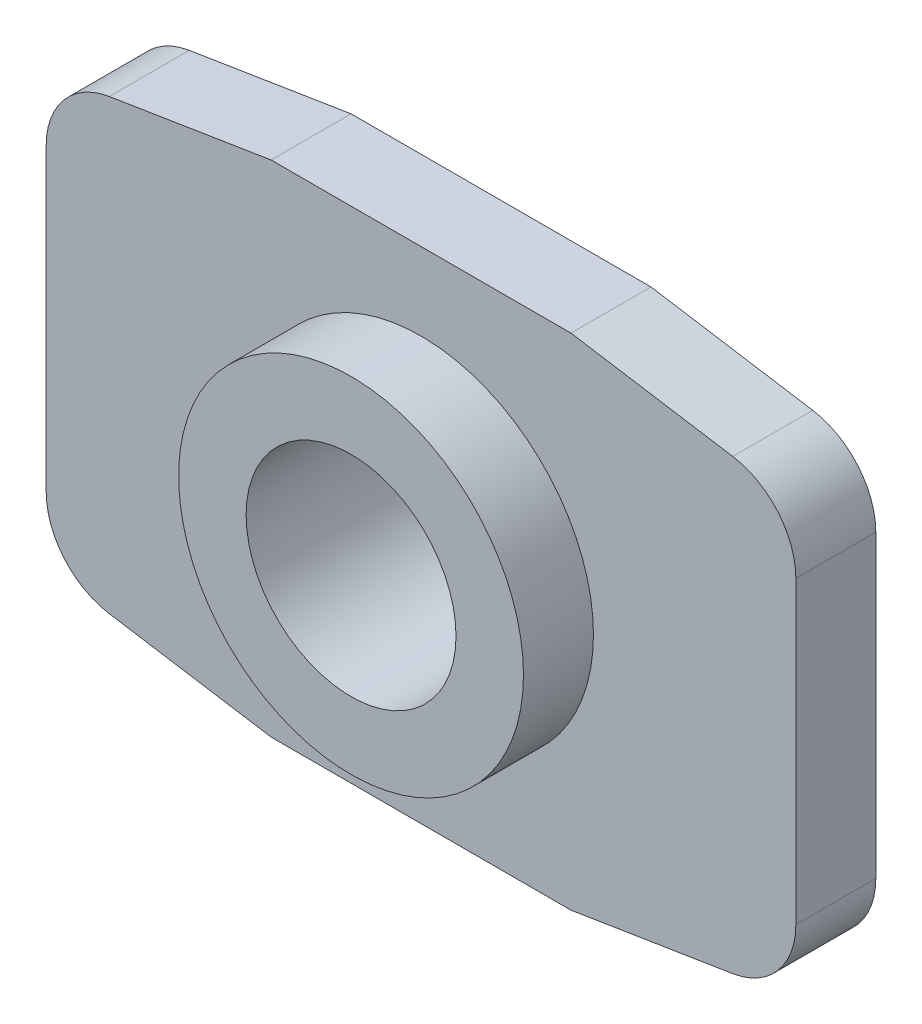
ISO-10303-21;
HEADER;
FILE_DESCRIPTION(('STEP AP214'),'2;1');
FILE_NAME('part.step','',(''),(''),'','','');
FILE_SCHEMA(('AUTOMOTIVE_DESIGN { 1 0 10303 214 1 1 1 1 }'));
ENDSEC;
DATA;
#1=APPLICATION_CONTEXT('core data for automotive mechanical design processes');
#2=APPLICATION_PROTOCOL_DEFINITION('international standard','automotive_design',2000,#1);
#3=PRODUCT_CONTEXT('',#1,'mechanical');
#4=PRODUCT('Part','Part','',(#3));
#5=PRODUCT_RELATED_PRODUCT_CATEGORY('part','',(#4));
#6=PRODUCT_DEFINITION_FORMATION('','',#4);
#7=PRODUCT_DEFINITION_CONTEXT('part definition',#1,'design');
#8=PRODUCT_DEFINITION('design','',#6,#7);
#9=PRODUCT_DEFINITION_SHAPE('','',#8);
#10=(LENGTH_UNIT() NAMED_UNIT(*) SI_UNIT(.MILLI.,.METRE.));
#11=(NAMED_UNIT(*) PLANE_ANGLE_UNIT() SI_UNIT($,.RADIAN.));
#12=(NAMED_UNIT(*) SI_UNIT($,.STERADIAN.) SOLID_ANGLE_UNIT());
#13=UNCERTAINTY_MEASURE_WITH_UNIT(LENGTH_MEASURE(1.E-05),#10,'distance_accuracy_value','');
#14=(GEOMETRIC_REPRESENTATION_CONTEXT(3) GLOBAL_UNCERTAINTY_ASSIGNED_CONTEXT((#13)) GLOBAL_UNIT_ASSIGNED_CONTEXT((#10,
#11,#12)) REPRESENTATION_CONTEXT('',''));
#15=CARTESIAN_POINT('',(0.,0.,0.));
#16=DIRECTION('',(0.,0.,1.));
#17=DIRECTION('',(1.,0.,0.));
#18=AXIS2_PLACEMENT_3D('',#15,#16,#17);
#19=CARTESIAN_POINT('',(6.,3.,1.6));
#20=DIRECTION('',(0.,0.,1.));
#21=DIRECTION('',(1.,0.,0.));
#22=AXIS2_PLACEMENT_3D('',#19,#20,#21);
#23=PLANE('',#22);
#24=CARTESIAN_POINT('',(6.,3.,1.6));
#25=DIRECTION('',(0.,0.,1.));
#26=DIRECTION('',(1.,0.,0.));
#27=AXIS2_PLACEMENT_3D('',#24,#25,#26);
#28=CIRCLE('',#27,1.5);
#29=CARTESIAN_POINT('',(7.5,3.,1.6));
#30=VERTEX_POINT('',#29);
#31=CARTESIAN_POINT('',(6.23739675280407,4.48109512920611,1.6));
#32=VERTEX_POINT('',#31);
#33=EDGE_CURVE('E178',#30,#32,#28,.T.);
#34=ORIENTED_EDGE('',*,*,#33,.T.);
#35=DIRECTION('',(-0.987396752804077,0.158264501869385,0.));
#36=VECTOR('',#35,1.);
#37=CARTESIAN_POINT('',(6.23739675280407,4.48109512920611,1.6));
#38=LINE('',#37,#36);
#39=CARTESIAN_POINT('',(3.,5.,1.6));
#40=VERTEX_POINT('',#39);
#41=EDGE_CURVE('E106',#32,#40,#38,.T.);
#42=ORIENTED_EDGE('',*,*,#41,.T.);
#43=DIRECTION('',(-1.,0.,0.));
#44=VECTOR('',#43,1.);
#45=CARTESIAN_POINT('',(-3.,5.,1.6));
#46=LINE('',#45,#44);
#47=CARTESIAN_POINT('',(-3.,5.,1.6));
#48=VERTEX_POINT('',#47);
#49=EDGE_CURVE('E205',#40,#48,#46,.T.);
#50=ORIENTED_EDGE('',*,*,#49,.T.);
#51=DIRECTION('',(-0.987396752804077,-0.158264501869386,0.));
#52=VECTOR('',#51,1.);
#53=CARTESIAN_POINT('',(-6.23739675280407,4.48109512920611,1.6));
#54=LINE('',#53,#52);
#55=CARTESIAN_POINT('',(-6.23739675280407,4.48109512920611,1.6));
#56=VERTEX_POINT('',#55);
#57=EDGE_CURVE('E223',#48,#56,#54,.T.);
#58=ORIENTED_EDGE('',*,*,#57,.T.);
#59=CARTESIAN_POINT('',(-6.,3.,1.6));
#60=DIRECTION('',(0.,0.,1.));
#61=DIRECTION('',(-1.,0.,0.));
#62=AXIS2_PLACEMENT_3D('',#59,#60,#61);
#63=CIRCLE('',#62,1.5);
#64=CARTESIAN_POINT('',(-7.5,3.,1.6));
#65=VERTEX_POINT('',#64);
#66=EDGE_CURVE('E220',#56,#65,#63,.T.);
#67=ORIENTED_EDGE('',*,*,#66,.T.);
#68=DIRECTION('',(0.,-1.,0.));
#69=VECTOR('',#68,1.);
#70=CARTESIAN_POINT('',(-7.5,-3.,1.6));
#71=LINE('',#70,#69);
#72=CARTESIAN_POINT('',(-7.5,-3.,1.6));
#73=VERTEX_POINT('',#72);
#74=EDGE_CURVE('E222',#65,#73,#71,.T.);
#75=ORIENTED_EDGE('',*,*,#74,.T.);
#76=CARTESIAN_POINT('',(-6.,-3.,1.6));
#77=DIRECTION('',(0.,0.,1.));
#78=DIRECTION('',(1.,0.,0.));
#79=AXIS2_PLACEMENT_3D('',#76,#77,#78);
#80=CIRCLE('',#79,1.5);
#81=CARTESIAN_POINT('',(-6.23739675280407,-4.48109512920612,1.6));
#82=VERTEX_POINT('',#81);
#83=EDGE_CURVE('E225',#73,#82,#80,.T.);
#84=ORIENTED_EDGE('',*,*,#83,.T.);
#85=DIRECTION('',(0.987396752804077,-0.158264501869385,0.));
#86=VECTOR('',#85,1.);
#87=CARTESIAN_POINT('',(-6.23739675280407,-4.48109512920612,1.6));
#88=LINE('',#87,#86);
#89=CARTESIAN_POINT('',(-3.,-5.,1.6));
#90=VERTEX_POINT('',#89);
#91=EDGE_CURVE('E231',#82,#90,#88,.T.);
#92=ORIENTED_EDGE('',*,*,#91,.T.);
#93=DIRECTION('',(1.,0.,0.));
#94=VECTOR('',#93,1.);
#95=CARTESIAN_POINT('',(-3.,-5.,1.6));
#96=LINE('',#95,#94);
#97=CARTESIAN_POINT('',(3.,-5.,1.6));
#98=VERTEX_POINT('',#97);
#99=EDGE_CURVE('E137',#90,#98,#96,.T.);
#100=ORIENTED_EDGE('',*,*,#99,.T.);
#101=DIRECTION('',(0.987396752804077,0.158264501869385,0.));
#102=VECTOR('',#101,1.);
#103=CARTESIAN_POINT('',(6.23739675280407,-4.48109512920611,1.6));
#104=LINE('',#103,#102);
#105=CARTESIAN_POINT('',(6.23739675280407,-4.48109512920612,1.6));
#106=VERTEX_POINT('',#105);
#107=EDGE_CURVE('E131',#98,#106,#104,.T.);
#108=ORIENTED_EDGE('',*,*,#107,.T.);
#109=CARTESIAN_POINT('',(6.,-3.,1.6));
#110=DIRECTION('',(0.,0.,1.));
#111=DIRECTION('',(-1.,0.,0.));
#112=AXIS2_PLACEMENT_3D('',#109,#110,#111);
#113=CIRCLE('',#112,1.5);
#114=CARTESIAN_POINT('',(7.5,-3.,1.6));
#115=VERTEX_POINT('',#114);
#116=EDGE_CURVE('E135',#106,#115,#113,.T.);
#117=ORIENTED_EDGE('',*,*,#116,.T.);
#118=DIRECTION('',(0.,1.,0.));
#119=VECTOR('',#118,1.);
#120=CARTESIAN_POINT('',(7.5,-3.,1.6));
#121=LINE('',#120,#119);
#122=EDGE_CURVE('E51',#115,#30,#121,.T.);
#123=ORIENTED_EDGE('',*,*,#122,.T.);
#124=EDGE_LOOP('',(#34,#42,#50,#58,#67,#75,#84,#92,#100,#108,#117,#123));
#125=FACE_BOUND('',#124,.T.);
#126=CARTESIAN_POINT('',(0.,0.,1.6));
#127=DIRECTION('',(0.,0.,1.));
#128=DIRECTION('',(1.,0.,0.));
#129=AXIS2_PLACEMENT_3D('',#126,#127,#128);
#130=CIRCLE('',#129,3.45);
#131=CARTESIAN_POINT('',(3.45,0.,1.6));
#132=VERTEX_POINT('',#131);
#133=EDGE_CURVE('E283',#132,#132,#130,.T.);
#134=ORIENTED_EDGE('',*,*,#133,.F.);
#135=EDGE_LOOP('',(#134));
#136=FACE_BOUND('',#135,.T.);
#137=ADVANCED_FACE('F34',(#125,#136),#23,.T.);
#138=CARTESIAN_POINT('',(6.,3.,1.6));
#139=DIRECTION('',(0.,0.,-1.));
#140=DIRECTION('',(-1.,0.,0.));
#141=AXIS2_PLACEMENT_3D('',#138,#139,#140);
#142=CYLINDRICAL_SURFACE('',#141,1.5);
#143=CARTESIAN_POINT('',(6.,3.,0.));
#144=DIRECTION('',(0.,0.,1.));
#145=DIRECTION('',(1.,0.,0.));
#146=AXIS2_PLACEMENT_3D('',#143,#144,#145);
#147=CIRCLE('',#146,1.5);
#148=CARTESIAN_POINT('',(7.5,3.,0.));
#149=VERTEX_POINT('',#148);
#150=CARTESIAN_POINT('',(6.23739675280407,4.48109512920611,0.));
#151=VERTEX_POINT('',#150);
#152=EDGE_CURVE('E155',#149,#151,#147,.T.);
#153=ORIENTED_EDGE('',*,*,#152,.T.);
#154=DIRECTION('',(0.,0.,-1.));
#155=VECTOR('',#154,1.);
#156=CARTESIAN_POINT('',(6.23739675280407,4.48109512920611,1.6));
#157=LINE('',#156,#155);
#158=EDGE_CURVE('E11',#32,#151,#157,.T.);
#159=ORIENTED_EDGE('',*,*,#158,.F.);
#160=ORIENTED_EDGE('',*,*,#33,.F.);
#161=DIRECTION('',(0.,0.,-1.));
#162=VECTOR('',#161,1.);
#163=CARTESIAN_POINT('',(7.5,3.,1.6));
#164=LINE('',#163,#162);
#165=EDGE_CURVE('E151',#30,#149,#164,.T.);
#166=ORIENTED_EDGE('',*,*,#165,.T.);
#167=EDGE_LOOP('',(#153,#159,#160,#166));
#168=FACE_BOUND('',#167,.T.);
#169=ADVANCED_FACE('F36',(#168),#142,.T.);
#170=CARTESIAN_POINT('',(6.23739675280407,4.48109512920611,1.6));
#171=DIRECTION('',(-0.158264501869385,-0.987396752804077,0.));
#172=DIRECTION('',(0.987396752804077,-0.158264501869385,0.));
#173=AXIS2_PLACEMENT_3D('',#170,#171,#172);
#174=PLANE('',#173);
#175=DIRECTION('',(-0.987396752804077,0.158264501869385,0.));
#176=VECTOR('',#175,1.);
#177=CARTESIAN_POINT('',(6.23739675280407,4.48109512920611,0.));
#178=LINE('',#177,#176);
#179=CARTESIAN_POINT('',(3.,5.,0.));
#180=VERTEX_POINT('',#179);
#181=EDGE_CURVE('E158',#151,#180,#178,.T.);
#182=ORIENTED_EDGE('',*,*,#181,.T.);
#183=DIRECTION('',(0.,0.,-1.));
#184=VECTOR('',#183,1.);
#185=CARTESIAN_POINT('',(3.,5.,1.6));
#186=LINE('',#185,#184);
#187=EDGE_CURVE('E43',#40,#180,#186,.T.);
#188=ORIENTED_EDGE('',*,*,#187,.F.);
#189=ORIENTED_EDGE('',*,*,#41,.F.);
#190=ORIENTED_EDGE('',*,*,#158,.T.);
#191=EDGE_LOOP('',(#182,#188,#189,#190));
#192=FACE_BOUND('',#191,.T.);
#193=ADVANCED_FACE('F261',(#192),#174,.F.);
#194=CARTESIAN_POINT('',(-3.,5.,1.6));
#195=DIRECTION('',(0.,-1.,0.));
#196=DIRECTION('',(0.,0.,-1.));
#197=AXIS2_PLACEMENT_3D('',#194,#195,#196);
#198=PLANE('',#197);
#199=DIRECTION('',(-1.,0.,0.));
#200=VECTOR('',#199,1.);
#201=CARTESIAN_POINT('',(-3.,5.,0.));
#202=LINE('',#201,#200);
#203=CARTESIAN_POINT('',(-3.,5.,0.));
#204=VERTEX_POINT('',#203);
#205=EDGE_CURVE('E161',#180,#204,#202,.T.);
#206=ORIENTED_EDGE('',*,*,#205,.T.);
#207=DIRECTION('',(0.,0.,-1.));
#208=VECTOR('',#207,1.);
#209=CARTESIAN_POINT('',(-3.,5.,1.6));
#210=LINE('',#209,#208);
#211=EDGE_CURVE('E197',#48,#204,#210,.T.);
#212=ORIENTED_EDGE('',*,*,#211,.F.);
#213=ORIENTED_EDGE('',*,*,#49,.F.);
#214=ORIENTED_EDGE('',*,*,#187,.T.);
#215=EDGE_LOOP('',(#206,#212,#213,#214));
#216=FACE_BOUND('',#215,.T.);
#217=ADVANCED_FACE('F203',(#216),#198,.F.);
#218=CARTESIAN_POINT('',(-6.23739675280407,4.48109512920611,1.6));
#219=DIRECTION('',(0.158264501869386,-0.987396752804077,0.));
#220=DIRECTION('',(0.987396752804077,0.158264501869386,0.));
#221=AXIS2_PLACEMENT_3D('',#218,#219,#220);
#222=PLANE('',#221);
#223=DIRECTION('',(-0.987396752804077,-0.158264501869386,0.));
#224=VECTOR('',#223,1.);
#225=CARTESIAN_POINT('',(-6.23739675280407,4.48109512920611,0.));
#226=LINE('',#225,#224);
#227=CARTESIAN_POINT('',(-6.23739675280407,4.48109512920611,0.));
#228=VERTEX_POINT('',#227);
#229=EDGE_CURVE('E163',#204,#228,#226,.T.);
#230=ORIENTED_EDGE('',*,*,#229,.T.);
#231=DIRECTION('',(0.,0.,-1.));
#232=VECTOR('',#231,1.);
#233=CARTESIAN_POINT('',(-6.23739675280407,4.48109512920611,1.6));
#234=LINE('',#233,#232);
#235=EDGE_CURVE('E194',#56,#228,#234,.T.);
#236=ORIENTED_EDGE('',*,*,#235,.F.);
#237=ORIENTED_EDGE('',*,*,#57,.F.);
#238=ORIENTED_EDGE('',*,*,#211,.T.);
#239=EDGE_LOOP('',(#230,#236,#237,#238));
#240=FACE_BOUND('',#239,.T.);
#241=ADVANCED_FACE('F214',(#240),#222,.F.);
#242=CARTESIAN_POINT('',(-6.,3.,1.6));
#243=DIRECTION('',(0.,0.,-1.));
#244=DIRECTION('',(-1.,0.,0.));
#245=AXIS2_PLACEMENT_3D('',#242,#243,#244);
#246=CYLINDRICAL_SURFACE('',#245,1.5);
#247=CARTESIAN_POINT('',(-6.,3.,0.));
#248=DIRECTION('',(0.,0.,1.));
#249=DIRECTION('',(-1.,0.,0.));
#250=AXIS2_PLACEMENT_3D('',#247,#248,#249);
#251=CIRCLE('',#250,1.5);
#252=CARTESIAN_POINT('',(-7.5,3.,0.));
#253=VERTEX_POINT('',#252);
#254=EDGE_CURVE('E165',#228,#253,#251,.T.);
#255=ORIENTED_EDGE('',*,*,#254,.T.);
#256=DIRECTION('',(0.,0.,-1.));
#257=VECTOR('',#256,1.);
#258=CARTESIAN_POINT('',(-7.5,3.,1.6));
#259=LINE('',#258,#257);
#260=EDGE_CURVE('E191',#65,#253,#259,.T.);
#261=ORIENTED_EDGE('',*,*,#260,.F.);
#262=ORIENTED_EDGE('',*,*,#66,.F.);
#263=ORIENTED_EDGE('',*,*,#235,.T.);
#264=EDGE_LOOP('',(#255,#261,#262,#263));
#265=FACE_BOUND('',#264,.T.);
#266=ADVANCED_FACE('F218',(#265),#246,.T.);
#267=CARTESIAN_POINT('',(-7.5,-3.,1.6));
#268=DIRECTION('',(1.,0.,0.));
#269=DIRECTION('',(0.,0.,-1.));
#270=AXIS2_PLACEMENT_3D('',#267,#268,#269);
#271=PLANE('',#270);
#272=DIRECTION('',(0.,-1.,0.));
#273=VECTOR('',#272,1.);
#274=CARTESIAN_POINT('',(-7.5,-3.,0.));
#275=LINE('',#274,#273);
#276=CARTESIAN_POINT('',(-7.5,-3.,0.));
#277=VERTEX_POINT('',#276);
#278=EDGE_CURVE('E167',#253,#277,#275,.T.);
#279=ORIENTED_EDGE('',*,*,#278,.T.);
#280=DIRECTION('',(0.,0.,-1.));
#281=VECTOR('',#280,1.);
#282=CARTESIAN_POINT('',(-7.5,-3.,1.6));
#283=LINE('',#282,#281);
#284=EDGE_CURVE('E188',#73,#277,#283,.T.);
#285=ORIENTED_EDGE('',*,*,#284,.F.);
#286=ORIENTED_EDGE('',*,*,#74,.F.);
#287=ORIENTED_EDGE('',*,*,#260,.T.);
#288=EDGE_LOOP('',(#279,#285,#286,#287));
#289=FACE_BOUND('',#288,.T.);
#290=ADVANCED_FACE('F361',(#289),#271,.F.);
#291=CARTESIAN_POINT('',(-6.,-3.,1.6));
#292=DIRECTION('',(0.,0.,-1.));
#293=DIRECTION('',(-1.,0.,0.));
#294=AXIS2_PLACEMENT_3D('',#291,#292,#293);
#295=CYLINDRICAL_SURFACE('',#294,1.5);
#296=CARTESIAN_POINT('',(-6.,-3.,0.));
#297=DIRECTION('',(0.,0.,1.));
#298=DIRECTION('',(1.,0.,0.));
#299=AXIS2_PLACEMENT_3D('',#296,#297,#298);
#300=CIRCLE('',#299,1.5);
#301=CARTESIAN_POINT('',(-6.23739675280407,-4.48109512920612,0.));
#302=VERTEX_POINT('',#301);
#303=EDGE_CURVE('E169',#277,#302,#300,.T.);
#304=ORIENTED_EDGE('',*,*,#303,.T.);
#305=DIRECTION('',(0.,0.,-1.));
#306=VECTOR('',#305,1.);
#307=CARTESIAN_POINT('',(-6.23739675280407,-4.48109512920612,1.6));
#308=LINE('',#307,#306);
#309=EDGE_CURVE('E185',#82,#302,#308,.T.);
#310=ORIENTED_EDGE('',*,*,#309,.F.);
#311=ORIENTED_EDGE('',*,*,#83,.F.);
#312=ORIENTED_EDGE('',*,*,#284,.T.);
#313=EDGE_LOOP('',(#304,#310,#311,#312));
#314=FACE_BOUND('',#313,.T.);
#315=ADVANCED_FACE('F352',(#314),#295,.T.);
#316=CARTESIAN_POINT('',(-6.23739675280407,-4.48109512920612,1.6));
#317=DIRECTION('',(0.158264501869385,0.987396752804077,0.));
#318=DIRECTION('',(-0.987396752804077,0.158264501869385,0.));
#319=AXIS2_PLACEMENT_3D('',#316,#317,#318);
#320=PLANE('',#319);
#321=DIRECTION('',(0.987396752804077,-0.158264501869385,0.));
#322=VECTOR('',#321,1.);
#323=CARTESIAN_POINT('',(-6.23739675280407,-4.48109512920612,0.));
#324=LINE('',#323,#322);
#325=CARTESIAN_POINT('',(-3.,-5.,0.));
#326=VERTEX_POINT('',#325);
#327=EDGE_CURVE('E171',#302,#326,#324,.T.);
#328=ORIENTED_EDGE('',*,*,#327,.T.);
#329=DIRECTION('',(0.,0.,-1.));
#330=VECTOR('',#329,1.);
#331=CARTESIAN_POINT('',(-3.,-5.,1.6));
#332=LINE('',#331,#330);
#333=EDGE_CURVE('E182',#90,#326,#332,.T.);
#334=ORIENTED_EDGE('',*,*,#333,.F.);
#335=ORIENTED_EDGE('',*,*,#91,.F.);
#336=ORIENTED_EDGE('',*,*,#309,.T.);
#337=EDGE_LOOP('',(#328,#334,#335,#336));
#338=FACE_BOUND('',#337,.T.);
#339=ADVANCED_FACE('F237',(#338),#320,.F.);
#340=CARTESIAN_POINT('',(-3.,-5.,1.6));
#341=DIRECTION('',(0.,1.,0.));
#342=DIRECTION('',(0.,0.,1.));
#343=AXIS2_PLACEMENT_3D('',#340,#341,#342);
#344=PLANE('',#343);
#345=DIRECTION('',(1.,0.,0.));
#346=VECTOR('',#345,1.);
#347=CARTESIAN_POINT('',(-3.,-5.,0.));
#348=LINE('',#347,#346);
#349=CARTESIAN_POINT('',(3.,-5.,0.));
#350=VERTEX_POINT('',#349);
#351=EDGE_CURVE('E173',#326,#350,#348,.T.);
#352=ORIENTED_EDGE('',*,*,#351,.T.);
#353=DIRECTION('',(0.,0.,-1.));
#354=VECTOR('',#353,1.);
#355=CARTESIAN_POINT('',(3.,-5.,1.6));
#356=LINE('',#355,#354);
#357=EDGE_CURVE('E146',#98,#350,#356,.T.);
#358=ORIENTED_EDGE('',*,*,#357,.F.);
#359=ORIENTED_EDGE('',*,*,#99,.F.);
#360=ORIENTED_EDGE('',*,*,#333,.T.);
#361=EDGE_LOOP('',(#352,#358,#359,#360));
#362=FACE_BOUND('',#361,.T.);
#363=ADVANCED_FACE('F241',(#362),#344,.F.);
#364=CARTESIAN_POINT('',(6.23739675280407,-4.48109512920611,1.6));
#365=DIRECTION('',(-0.158264501869385,0.987396752804077,0.));
#366=DIRECTION('',(-0.987396752804077,-0.158264501869385,0.));
#367=AXIS2_PLACEMENT_3D('',#364,#365,#366);
#368=PLANE('',#367);
#369=DIRECTION('',(0.987396752804077,0.158264501869385,0.));
#370=VECTOR('',#369,1.);
#371=CARTESIAN_POINT('',(6.23739675280407,-4.48109512920611,0.));
#372=LINE('',#371,#370);
#373=CARTESIAN_POINT('',(6.23739675280407,-4.48109512920612,0.));
#374=VERTEX_POINT('',#373);
#375=EDGE_CURVE('E145',#350,#374,#372,.T.);
#376=ORIENTED_EDGE('',*,*,#375,.T.);
#377=DIRECTION('',(0.,0.,-1.));
#378=VECTOR('',#377,1.);
#379=CARTESIAN_POINT('',(6.23739675280407,-4.48109512920612,1.6));
#380=LINE('',#379,#378);
#381=EDGE_CURVE('E142',#106,#374,#380,.T.);
#382=ORIENTED_EDGE('',*,*,#381,.F.);
#383=ORIENTED_EDGE('',*,*,#107,.F.);
#384=ORIENTED_EDGE('',*,*,#357,.T.);
#385=EDGE_LOOP('',(#376,#382,#383,#384));
#386=FACE_BOUND('',#385,.T.);
#387=ADVANCED_FACE('F143',(#386),#368,.F.);
#388=CARTESIAN_POINT('',(6.,-3.,1.6));
#389=DIRECTION('',(0.,0.,-1.));
#390=DIRECTION('',(-1.,0.,0.));
#391=AXIS2_PLACEMENT_3D('',#388,#389,#390);
#392=CYLINDRICAL_SURFACE('',#391,1.5);
#393=CARTESIAN_POINT('',(6.,-3.,0.));
#394=DIRECTION('',(0.,0.,1.));
#395=DIRECTION('',(-1.,0.,0.));
#396=AXIS2_PLACEMENT_3D('',#393,#394,#395);
#397=CIRCLE('',#396,1.5);
#398=CARTESIAN_POINT('',(7.5,-3.,0.));
#399=VERTEX_POINT('',#398);
#400=EDGE_CURVE('E92',#374,#399,#397,.T.);
#401=ORIENTED_EDGE('',*,*,#400,.T.);
#402=DIRECTION('',(0.,0.,-1.));
#403=VECTOR('',#402,1.);
#404=CARTESIAN_POINT('',(7.5,-3.,1.6));
#405=LINE('',#404,#403);
#406=EDGE_CURVE('E147',#115,#399,#405,.T.);
#407=ORIENTED_EDGE('',*,*,#406,.F.);
#408=ORIENTED_EDGE('',*,*,#116,.F.);
#409=ORIENTED_EDGE('',*,*,#381,.T.);
#410=EDGE_LOOP('',(#401,#407,#408,#409));
#411=FACE_BOUND('',#410,.T.);
#412=ADVANCED_FACE('F149',(#411),#392,.T.);
#413=CARTESIAN_POINT('',(7.5,-3.,1.6));
#414=DIRECTION('',(-1.,0.,0.));
#415=DIRECTION('',(0.,-1.,0.));
#416=AXIS2_PLACEMENT_3D('',#413,#414,#415);
#417=PLANE('',#416);
#418=DIRECTION('',(0.,1.,0.));
#419=VECTOR('',#418,1.);
#420=CARTESIAN_POINT('',(7.5,-3.,0.));
#421=LINE('',#420,#419);
#422=EDGE_CURVE('E98',#399,#149,#421,.T.);
#423=ORIENTED_EDGE('',*,*,#422,.T.);
#424=ORIENTED_EDGE('',*,*,#165,.F.);
#425=ORIENTED_EDGE('',*,*,#122,.F.);
#426=ORIENTED_EDGE('',*,*,#406,.T.);
#427=EDGE_LOOP('',(#423,#424,#425,#426));
#428=FACE_BOUND('',#427,.T.);
#429=ADVANCED_FACE('F245',(#428),#417,.F.);
#430=CARTESIAN_POINT('',(6.,3.,0.));
#431=DIRECTION('',(0.,0.,1.));
#432=DIRECTION('',(1.,0.,0.));
#433=AXIS2_PLACEMENT_3D('',#430,#431,#432);
#434=PLANE('',#433);
#435=CARTESIAN_POINT('',(0.,0.,0.));
#436=DIRECTION('',(0.,0.,1.));
#437=DIRECTION('',(1.,0.,0.));
#438=AXIS2_PLACEMENT_3D('',#435,#436,#437);
#439=CIRCLE('',#438,2.1);
#440=CARTESIAN_POINT('',(2.1,0.,0.));
#441=VERTEX_POINT('',#440);
#442=EDGE_CURVE('E278',#441,#441,#439,.T.);
#443=ORIENTED_EDGE('',*,*,#442,.T.);
#444=EDGE_LOOP('',(#443));
#445=FACE_BOUND('',#444,.T.);
#446=ORIENTED_EDGE('',*,*,#152,.F.);
#447=ORIENTED_EDGE('',*,*,#422,.F.);
#448=ORIENTED_EDGE('',*,*,#400,.F.);
#449=ORIENTED_EDGE('',*,*,#375,.F.);
#450=ORIENTED_EDGE('',*,*,#351,.F.);
#451=ORIENTED_EDGE('',*,*,#327,.F.);
#452=ORIENTED_EDGE('',*,*,#303,.F.);
#453=ORIENTED_EDGE('',*,*,#278,.F.);
#454=ORIENTED_EDGE('',*,*,#254,.F.);
#455=ORIENTED_EDGE('',*,*,#229,.F.);
#456=ORIENTED_EDGE('',*,*,#205,.F.);
#457=ORIENTED_EDGE('',*,*,#181,.F.);
#458=EDGE_LOOP('',(#446,#447,#448,#449,#450,#451,#452,#453,#454,#455,#456,#457));
#459=FACE_BOUND('',#458,.T.);
#460=ADVANCED_FACE('F209',(#445,#459),#434,.F.);
#461=CARTESIAN_POINT('',(0.,0.,3.));
#462=DIRECTION('',(0.,0.,-1.));
#463=DIRECTION('',(-1.,0.,0.));
#464=AXIS2_PLACEMENT_3D('',#461,#462,#463);
#465=CYLINDRICAL_SURFACE('',#464,3.45);
#466=CARTESIAN_POINT('',(0.,0.,3.));
#467=DIRECTION('',(0.,0.,1.));
#468=DIRECTION('',(1.,0.,0.));
#469=AXIS2_PLACEMENT_3D('',#466,#467,#468);
#470=CIRCLE('',#469,3.45);
#471=CARTESIAN_POINT('',(3.45,0.,3.));
#472=VERTEX_POINT('',#471);
#473=EDGE_CURVE('E159',#472,#472,#470,.T.);
#474=ORIENTED_EDGE('',*,*,#473,.F.);
#475=EDGE_LOOP('',(#474));
#476=FACE_BOUND('',#475,.T.);
#477=ORIENTED_EDGE('',*,*,#133,.T.);
#478=EDGE_LOOP('',(#477));
#479=FACE_BOUND('',#478,.T.);
#480=ADVANCED_FACE('F252',(#476,#479),#465,.T.);
#481=CARTESIAN_POINT('',(0.,0.,3.));
#482=DIRECTION('',(0.,0.,1.));
#483=DIRECTION('',(1.,0.,0.));
#484=AXIS2_PLACEMENT_3D('',#481,#482,#483);
#485=PLANE('',#484);
#486=CARTESIAN_POINT('',(0.,0.,3.));
#487=DIRECTION('',(0.,0.,1.));
#488=DIRECTION('',(1.,0.,0.));
#489=AXIS2_PLACEMENT_3D('',#486,#487,#488);
#490=CIRCLE('',#489,2.09999999999999);
#491=CARTESIAN_POINT('',(2.09999999999999,0.,3.));
#492=VERTEX_POINT('',#491);
#493=EDGE_CURVE('E281',#492,#492,#490,.T.);
#494=ORIENTED_EDGE('',*,*,#493,.F.);
#495=EDGE_LOOP('',(#494));
#496=FACE_BOUND('',#495,.T.);
#497=ORIENTED_EDGE('',*,*,#473,.T.);
#498=EDGE_LOOP('',(#497));
#499=FACE_BOUND('',#498,.T.);
#500=ADVANCED_FACE('F265',(#496,#499),#485,.T.);
#501=CARTESIAN_POINT('',(0.,0.,3.));
#502=DIRECTION('',(0.,0.,1.));
#503=DIRECTION('',(1.,0.,0.));
#504=AXIS2_PLACEMENT_3D('',#501,#502,#503);
#505=CYLINDRICAL_SURFACE('',#504,2.09999999999999);
#506=ORIENTED_EDGE('',*,*,#442,.F.);
#507=EDGE_LOOP('',(#506));
#508=FACE_BOUND('',#507,.T.);
#509=ORIENTED_EDGE('',*,*,#493,.T.);
#510=EDGE_LOOP('',(#509));
#511=FACE_BOUND('',#510,.T.);
#512=ADVANCED_FACE('F269',(#508,#511),#505,.F.);
#513=CLOSED_SHELL('',(#137,#169,#193,#217,#241,#266,#290,#315,#339,#363,#387,#412,#429,#460,
#480,#500,#512));
#514=MANIFOLD_SOLID_BREP('B2',#513);
#515=ADVANCED_BREP_SHAPE_REPRESENTATION('',(#18,#514),#14);
#516=SHAPE_DEFINITION_REPRESENTATION(#9,#515);
ENDSEC;
END-ISO-10303-21;
